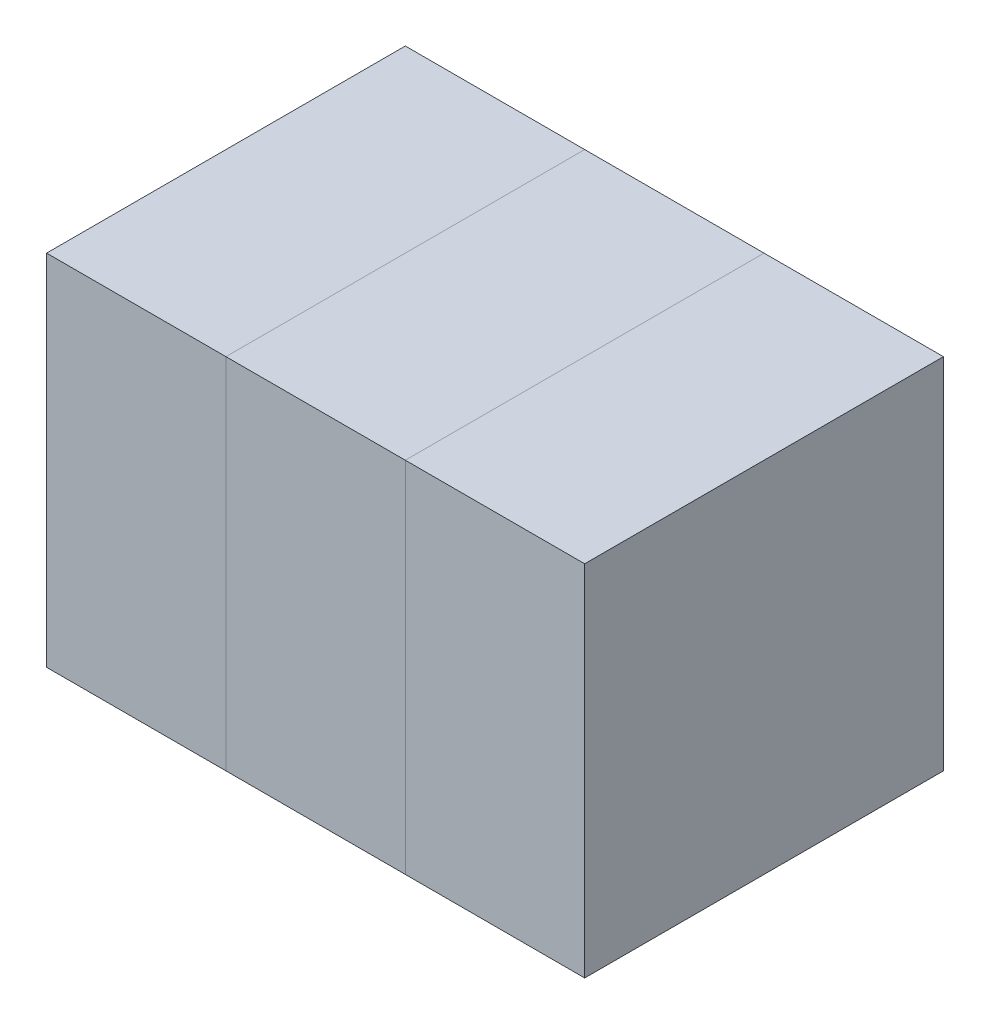
ISO-10303-21;
HEADER;
FILE_DESCRIPTION(('STEP AP214'),'2;1');
FILE_NAME('part.step','',(''),(''),'','','');
FILE_SCHEMA(('AUTOMOTIVE_DESIGN { 1 0 10303 214 1 1 1 1 }'));
ENDSEC;
DATA;
#1=APPLICATION_CONTEXT('core data for automotive mechanical design processes');
#2=APPLICATION_PROTOCOL_DEFINITION('international standard','automotive_design',2000,#1);
#3=PRODUCT_CONTEXT('',#1,'mechanical');
#4=PRODUCT('Part','Part','',(#3));
#5=PRODUCT_RELATED_PRODUCT_CATEGORY('part','',(#4));
#6=PRODUCT_DEFINITION_FORMATION('','',#4);
#7=PRODUCT_DEFINITION_CONTEXT('part definition',#1,'design');
#8=PRODUCT_DEFINITION('design','',#6,#7);
#9=PRODUCT_DEFINITION_SHAPE('','',#8);
#10=(LENGTH_UNIT() NAMED_UNIT(*) SI_UNIT(.MILLI.,.METRE.));
#11=(NAMED_UNIT(*) PLANE_ANGLE_UNIT() SI_UNIT($,.RADIAN.));
#12=(NAMED_UNIT(*) SI_UNIT($,.STERADIAN.) SOLID_ANGLE_UNIT());
#13=UNCERTAINTY_MEASURE_WITH_UNIT(LENGTH_MEASURE(1.E-05),#10,'distance_accuracy_value','');
#14=(GEOMETRIC_REPRESENTATION_CONTEXT(3) GLOBAL_UNCERTAINTY_ASSIGNED_CONTEXT((#13)) GLOBAL_UNIT_ASSIGNED_CONTEXT((#10,
#11,#12)) REPRESENTATION_CONTEXT('',''));
#15=CARTESIAN_POINT('',(0.,0.,0.));
#16=DIRECTION('',(0.,0.,1.));
#17=DIRECTION('',(1.,0.,0.));
#18=AXIS2_PLACEMENT_3D('',#15,#16,#17);
#19=CARTESIAN_POINT('',(0.2,0.8,-0.4));
#20=DIRECTION('',(1.,0.,0.));
#21=DIRECTION('',(0.,0.,-1.));
#22=AXIS2_PLACEMENT_3D('',#19,#20,#21);
#23=PLANE('',#22);
#24=DIRECTION('',(0.,0.,1.));
#25=VECTOR('',#24,1.);
#26=CARTESIAN_POINT('',(0.2,0.,-0.4));
#27=LINE('',#26,#25);
#28=CARTESIAN_POINT('',(0.2,0.,-0.4));
#29=VERTEX_POINT('',#28);
#30=CARTESIAN_POINT('',(0.2,0.,0.4));
#31=VERTEX_POINT('',#30);
#32=EDGE_CURVE('E107',#29,#31,#27,.T.);
#33=ORIENTED_EDGE('',*,*,#32,.T.);
#34=DIRECTION('',(0.,-1.,0.));
#35=VECTOR('',#34,1.);
#36=CARTESIAN_POINT('',(0.2,0.8,0.4));
#37=LINE('',#36,#35);
#38=CARTESIAN_POINT('',(0.2,0.8,0.4));
#39=VERTEX_POINT('',#38);
#40=EDGE_CURVE('E12',#39,#31,#37,.T.);
#41=ORIENTED_EDGE('',*,*,#40,.F.);
#42=DIRECTION('',(0.,0.,1.));
#43=VECTOR('',#42,1.);
#44=CARTESIAN_POINT('',(0.2,0.8,-0.4));
#45=LINE('',#44,#43);
#46=CARTESIAN_POINT('',(0.2,0.8,-0.4));
#47=VERTEX_POINT('',#46);
#48=EDGE_CURVE('E95',#47,#39,#45,.T.);
#49=ORIENTED_EDGE('',*,*,#48,.F.);
#50=DIRECTION('',(0.,-1.,0.));
#51=VECTOR('',#50,1.);
#52=CARTESIAN_POINT('',(0.2,0.8,-0.4));
#53=LINE('',#52,#51);
#54=EDGE_CURVE('E103',#47,#29,#53,.T.);
#55=ORIENTED_EDGE('',*,*,#54,.T.);
#56=EDGE_LOOP('',(#33,#41,#49,#55));
#57=FACE_BOUND('',#56,.T.);
#58=ADVANCED_FACE('F44',(#57),#23,.F.);
#59=CARTESIAN_POINT('',(0.2,0.8,0.4));
#60=DIRECTION('',(0.,0.,-1.));
#61=DIRECTION('',(-1.,0.,0.));
#62=AXIS2_PLACEMENT_3D('',#59,#60,#61);
#63=PLANE('',#62);
#64=DIRECTION('',(1.,0.,0.));
#65=VECTOR('',#64,1.);
#66=CARTESIAN_POINT('',(0.2,0.,0.4));
#67=LINE('',#66,#65);
#68=CARTESIAN_POINT('',(0.6,0.,0.4));
#69=VERTEX_POINT('',#68);
#70=EDGE_CURVE('E99',#31,#69,#67,.T.);
#71=ORIENTED_EDGE('',*,*,#70,.T.);
#72=DIRECTION('',(0.,-1.,0.));
#73=VECTOR('',#72,1.);
#74=CARTESIAN_POINT('',(0.6,0.8,0.4));
#75=LINE('',#74,#73);
#76=CARTESIAN_POINT('',(0.6,0.8,0.4));
#77=VERTEX_POINT('',#76);
#78=EDGE_CURVE('E52',#77,#69,#75,.T.);
#79=ORIENTED_EDGE('',*,*,#78,.F.);
#80=DIRECTION('',(1.,0.,0.));
#81=VECTOR('',#80,1.);
#82=CARTESIAN_POINT('',(0.2,0.8,0.4));
#83=LINE('',#82,#81);
#84=EDGE_CURVE('E90',#39,#77,#83,.T.);
#85=ORIENTED_EDGE('',*,*,#84,.F.);
#86=ORIENTED_EDGE('',*,*,#40,.T.);
#87=EDGE_LOOP('',(#71,#79,#85,#86));
#88=FACE_BOUND('',#87,.T.);
#89=ADVANCED_FACE('F98',(#88),#63,.F.);
#90=CARTESIAN_POINT('',(0.6,0.8,-0.4));
#91=DIRECTION('',(-1.,0.,0.));
#92=DIRECTION('',(0.,0.,1.));
#93=AXIS2_PLACEMENT_3D('',#90,#91,#92);
#94=PLANE('',#93);
#95=DIRECTION('',(0.,0.,-1.));
#96=VECTOR('',#95,1.);
#97=CARTESIAN_POINT('',(0.6,0.,-0.4));
#98=LINE('',#97,#96);
#99=CARTESIAN_POINT('',(0.6,0.,-0.4));
#100=VERTEX_POINT('',#99);
#101=EDGE_CURVE('E77',#69,#100,#98,.T.);
#102=ORIENTED_EDGE('',*,*,#101,.T.);
#103=DIRECTION('',(0.,-1.,0.));
#104=VECTOR('',#103,1.);
#105=CARTESIAN_POINT('',(0.6,0.8,-0.4));
#106=LINE('',#105,#104);
#107=CARTESIAN_POINT('',(0.6,0.8,-0.4));
#108=VERTEX_POINT('',#107);
#109=EDGE_CURVE('E100',#108,#100,#106,.T.);
#110=ORIENTED_EDGE('',*,*,#109,.F.);
#111=DIRECTION('',(0.,0.,-1.));
#112=VECTOR('',#111,1.);
#113=CARTESIAN_POINT('',(0.6,0.8,-0.4));
#114=LINE('',#113,#112);
#115=EDGE_CURVE('E93',#77,#108,#114,.T.);
#116=ORIENTED_EDGE('',*,*,#115,.F.);
#117=ORIENTED_EDGE('',*,*,#78,.T.);
#118=EDGE_LOOP('',(#102,#110,#116,#117));
#119=FACE_BOUND('',#118,.T.);
#120=ADVANCED_FACE('F101',(#119),#94,.F.);
#121=CARTESIAN_POINT('',(0.2,0.8,-0.4));
#122=DIRECTION('',(0.,0.,1.));
#123=DIRECTION('',(1.,0.,0.));
#124=AXIS2_PLACEMENT_3D('',#121,#122,#123);
#125=PLANE('',#124);
#126=DIRECTION('',(-1.,0.,0.));
#127=VECTOR('',#126,1.);
#128=CARTESIAN_POINT('',(0.2,0.,-0.4));
#129=LINE('',#128,#127);
#130=EDGE_CURVE('E83',#100,#29,#129,.T.);
#131=ORIENTED_EDGE('',*,*,#130,.T.);
#132=ORIENTED_EDGE('',*,*,#54,.F.);
#133=DIRECTION('',(-1.,0.,0.));
#134=VECTOR('',#133,1.);
#135=CARTESIAN_POINT('',(0.2,0.8,-0.4));
#136=LINE('',#135,#134);
#137=EDGE_CURVE('E60',#108,#47,#136,.T.);
#138=ORIENTED_EDGE('',*,*,#137,.F.);
#139=ORIENTED_EDGE('',*,*,#109,.T.);
#140=EDGE_LOOP('',(#131,#132,#138,#139));
#141=FACE_BOUND('',#140,.T.);
#142=ADVANCED_FACE('F114',(#141),#125,.F.);
#143=CARTESIAN_POINT('',(0.,0.8,0.));
#144=DIRECTION('',(0.,1.,0.));
#145=DIRECTION('',(0.,0.,1.));
#146=AXIS2_PLACEMENT_3D('',#143,#144,#145);
#147=PLANE('',#146);
#148=ORIENTED_EDGE('',*,*,#48,.T.);
#149=ORIENTED_EDGE('',*,*,#84,.T.);
#150=ORIENTED_EDGE('',*,*,#115,.T.);
#151=ORIENTED_EDGE('',*,*,#137,.T.);
#152=EDGE_LOOP('',(#148,#149,#150,#151));
#153=FACE_BOUND('',#152,.T.);
#154=ADVANCED_FACE('F91',(#153),#147,.T.);
#155=CARTESIAN_POINT('',(0.,0.,0.));
#156=DIRECTION('',(0.,1.,0.));
#157=DIRECTION('',(0.,0.,1.));
#158=AXIS2_PLACEMENT_3D('',#155,#156,#157);
#159=PLANE('',#158);
#160=ORIENTED_EDGE('',*,*,#32,.F.);
#161=ORIENTED_EDGE('',*,*,#130,.F.);
#162=ORIENTED_EDGE('',*,*,#101,.F.);
#163=ORIENTED_EDGE('',*,*,#70,.F.);
#164=EDGE_LOOP('',(#160,#161,#162,#163));
#165=FACE_BOUND('',#164,.T.);
#166=ADVANCED_FACE('F117',(#165),#159,.F.);
#167=CLOSED_SHELL('',(#58,#89,#120,#142,#154,#166));
#168=MANIFOLD_SOLID_BREP('B2',#167);
#169=CARTESIAN_POINT('',(-0.2,0.8,-0.4));
#170=DIRECTION('',(-1.,0.,0.));
#171=DIRECTION('',(0.,0.,1.));
#172=AXIS2_PLACEMENT_3D('',#169,#170,#171);
#173=PLANE('',#172);
#174=DIRECTION('',(0.,0.,-1.));
#175=VECTOR('',#174,1.);
#176=CARTESIAN_POINT('',(-0.2,0.,-0.4));
#177=LINE('',#176,#175);
#178=CARTESIAN_POINT('',(-0.2,0.,0.4));
#179=VERTEX_POINT('',#178);
#180=CARTESIAN_POINT('',(-0.2,0.,-0.4));
#181=VERTEX_POINT('',#180);
#182=EDGE_CURVE('E240',#179,#181,#177,.T.);
#183=ORIENTED_EDGE('',*,*,#182,.T.);
#184=DIRECTION('',(0.,-1.,0.));
#185=VECTOR('',#184,1.);
#186=CARTESIAN_POINT('',(-0.2,0.8,-0.4));
#187=LINE('',#186,#185);
#188=CARTESIAN_POINT('',(-0.2,0.8,-0.4));
#189=VERTEX_POINT('',#188);
#190=EDGE_CURVE('E42',#189,#181,#187,.T.);
#191=ORIENTED_EDGE('',*,*,#190,.F.);
#192=DIRECTION('',(0.,0.,-1.));
#193=VECTOR('',#192,1.);
#194=CARTESIAN_POINT('',(-0.2,0.8,-0.4));
#195=LINE('',#194,#193);
#196=CARTESIAN_POINT('',(-0.2,0.8,0.4));
#197=VERTEX_POINT('',#196);
#198=EDGE_CURVE('E228',#197,#189,#195,.T.);
#199=ORIENTED_EDGE('',*,*,#198,.F.);
#200=DIRECTION('',(0.,-1.,0.));
#201=VECTOR('',#200,1.);
#202=CARTESIAN_POINT('',(-0.2,0.8,0.4));
#203=LINE('',#202,#201);
#204=EDGE_CURVE('E236',#197,#179,#203,.T.);
#205=ORIENTED_EDGE('',*,*,#204,.T.);
#206=EDGE_LOOP('',(#183,#191,#199,#205));
#207=FACE_BOUND('',#206,.T.);
#208=ADVANCED_FACE('F177',(#207),#173,.F.);
#209=CARTESIAN_POINT('',(-0.2,0.8,-0.4));
#210=DIRECTION('',(0.,0.,1.));
#211=DIRECTION('',(1.,0.,0.));
#212=AXIS2_PLACEMENT_3D('',#209,#210,#211);
#213=PLANE('',#212);
#214=DIRECTION('',(-1.,0.,0.));
#215=VECTOR('',#214,1.);
#216=CARTESIAN_POINT('',(-0.2,0.,-0.4));
#217=LINE('',#216,#215);
#218=CARTESIAN_POINT('',(-0.6,0.,-0.4));
#219=VERTEX_POINT('',#218);
#220=EDGE_CURVE('E232',#181,#219,#217,.T.);
#221=ORIENTED_EDGE('',*,*,#220,.T.);
#222=DIRECTION('',(0.,-1.,0.));
#223=VECTOR('',#222,1.);
#224=CARTESIAN_POINT('',(-0.6,0.8,-0.4));
#225=LINE('',#224,#223);
#226=CARTESIAN_POINT('',(-0.6,0.8,-0.4));
#227=VERTEX_POINT('',#226);
#228=EDGE_CURVE('E185',#227,#219,#225,.T.);
#229=ORIENTED_EDGE('',*,*,#228,.F.);
#230=DIRECTION('',(-1.,0.,0.));
#231=VECTOR('',#230,1.);
#232=CARTESIAN_POINT('',(-0.2,0.8,-0.4));
#233=LINE('',#232,#231);
#234=EDGE_CURVE('E223',#189,#227,#233,.T.);
#235=ORIENTED_EDGE('',*,*,#234,.F.);
#236=ORIENTED_EDGE('',*,*,#190,.T.);
#237=EDGE_LOOP('',(#221,#229,#235,#236));
#238=FACE_BOUND('',#237,.T.);
#239=ADVANCED_FACE('F231',(#238),#213,.F.);
#240=CARTESIAN_POINT('',(-0.6,0.8,-0.4));
#241=DIRECTION('',(1.,0.,0.));
#242=DIRECTION('',(0.,0.,-1.));
#243=AXIS2_PLACEMENT_3D('',#240,#241,#242);
#244=PLANE('',#243);
#245=DIRECTION('',(0.,0.,1.));
#246=VECTOR('',#245,1.);
#247=CARTESIAN_POINT('',(-0.6,0.,-0.4));
#248=LINE('',#247,#246);
#249=CARTESIAN_POINT('',(-0.6,0.,0.4));
#250=VERTEX_POINT('',#249);
#251=EDGE_CURVE('E210',#219,#250,#248,.T.);
#252=ORIENTED_EDGE('',*,*,#251,.T.);
#253=DIRECTION('',(0.,-1.,0.));
#254=VECTOR('',#253,1.);
#255=CARTESIAN_POINT('',(-0.6,0.8,0.4));
#256=LINE('',#255,#254);
#257=CARTESIAN_POINT('',(-0.6,0.8,0.4));
#258=VERTEX_POINT('',#257);
#259=EDGE_CURVE('E233',#258,#250,#256,.T.);
#260=ORIENTED_EDGE('',*,*,#259,.F.);
#261=DIRECTION('',(0.,0.,1.));
#262=VECTOR('',#261,1.);
#263=CARTESIAN_POINT('',(-0.6,0.8,-0.4));
#264=LINE('',#263,#262);
#265=EDGE_CURVE('E226',#227,#258,#264,.T.);
#266=ORIENTED_EDGE('',*,*,#265,.F.);
#267=ORIENTED_EDGE('',*,*,#228,.T.);
#268=EDGE_LOOP('',(#252,#260,#266,#267));
#269=FACE_BOUND('',#268,.T.);
#270=ADVANCED_FACE('F234',(#269),#244,.F.);
#271=CARTESIAN_POINT('',(-0.2,0.8,0.4));
#272=DIRECTION('',(0.,0.,-1.));
#273=DIRECTION('',(-1.,0.,0.));
#274=AXIS2_PLACEMENT_3D('',#271,#272,#273);
#275=PLANE('',#274);
#276=DIRECTION('',(1.,0.,0.));
#277=VECTOR('',#276,1.);
#278=CARTESIAN_POINT('',(-0.2,0.,0.4));
#279=LINE('',#278,#277);
#280=EDGE_CURVE('E216',#250,#179,#279,.T.);
#281=ORIENTED_EDGE('',*,*,#280,.T.);
#282=ORIENTED_EDGE('',*,*,#204,.F.);
#283=DIRECTION('',(1.,0.,0.));
#284=VECTOR('',#283,1.);
#285=CARTESIAN_POINT('',(-0.2,0.8,0.4));
#286=LINE('',#285,#284);
#287=EDGE_CURVE('E193',#258,#197,#286,.T.);
#288=ORIENTED_EDGE('',*,*,#287,.F.);
#289=ORIENTED_EDGE('',*,*,#259,.T.);
#290=EDGE_LOOP('',(#281,#282,#288,#289));
#291=FACE_BOUND('',#290,.T.);
#292=ADVANCED_FACE('F247',(#291),#275,.F.);
#293=CARTESIAN_POINT('',(0.,0.8,0.));
#294=DIRECTION('',(0.,-1.,0.));
#295=DIRECTION('',(0.,0.,-1.));
#296=AXIS2_PLACEMENT_3D('',#293,#294,#295);
#297=PLANE('',#296);
#298=ORIENTED_EDGE('',*,*,#198,.T.);
#299=ORIENTED_EDGE('',*,*,#234,.T.);
#300=ORIENTED_EDGE('',*,*,#265,.T.);
#301=ORIENTED_EDGE('',*,*,#287,.T.);
#302=EDGE_LOOP('',(#298,#299,#300,#301));
#303=FACE_BOUND('',#302,.T.);
#304=ADVANCED_FACE('F224',(#303),#297,.F.);
#305=CARTESIAN_POINT('',(0.,0.,0.));
#306=DIRECTION('',(0.,-1.,0.));
#307=DIRECTION('',(0.,0.,-1.));
#308=AXIS2_PLACEMENT_3D('',#305,#306,#307);
#309=PLANE('',#308);
#310=ORIENTED_EDGE('',*,*,#182,.F.);
#311=ORIENTED_EDGE('',*,*,#280,.F.);
#312=ORIENTED_EDGE('',*,*,#251,.F.);
#313=ORIENTED_EDGE('',*,*,#220,.F.);
#314=EDGE_LOOP('',(#310,#311,#312,#313));
#315=FACE_BOUND('',#314,.T.);
#316=ADVANCED_FACE('F250',(#315),#309,.T.);
#317=CLOSED_SHELL('',(#208,#239,#270,#292,#304,#316));
#318=MANIFOLD_SOLID_BREP('B6',#317);
#319=CARTESIAN_POINT('',(0.2,0.8,0.4));
#320=DIRECTION('',(-1.,0.,0.));
#321=DIRECTION('',(0.,0.,1.));
#322=AXIS2_PLACEMENT_3D('',#319,#320,#321);
#323=PLANE('',#322);
#324=DIRECTION('',(0.,0.,-1.));
#325=VECTOR('',#324,1.);
#326=CARTESIAN_POINT('',(0.2,0.,0.4));
#327=LINE('',#326,#325);
#328=CARTESIAN_POINT('',(0.2,0.,0.4));
#329=VERTEX_POINT('',#328);
#330=CARTESIAN_POINT('',(0.2,0.,-0.4));
#331=VERTEX_POINT('',#330);
#332=EDGE_CURVE('E364',#329,#331,#327,.T.);
#333=ORIENTED_EDGE('',*,*,#332,.T.);
#334=DIRECTION('',(0.,-1.,0.));
#335=VECTOR('',#334,1.);
#336=CARTESIAN_POINT('',(0.2,0.8,-0.4));
#337=LINE('',#336,#335);
#338=CARTESIAN_POINT('',(0.2,0.8,-0.4));
#339=VERTEX_POINT('',#338);
#340=EDGE_CURVE('E175',#339,#331,#337,.T.);
#341=ORIENTED_EDGE('',*,*,#340,.F.);
#342=DIRECTION('',(0.,0.,-1.));
#343=VECTOR('',#342,1.);
#344=CARTESIAN_POINT('',(0.2,0.8,0.4));
#345=LINE('',#344,#343);
#346=CARTESIAN_POINT('',(0.2,0.8,0.4));
#347=VERTEX_POINT('',#346);
#348=EDGE_CURVE('E352',#347,#339,#345,.T.);
#349=ORIENTED_EDGE('',*,*,#348,.F.);
#350=DIRECTION('',(0.,-1.,0.));
#351=VECTOR('',#350,1.);
#352=CARTESIAN_POINT('',(0.2,0.8,0.4));
#353=LINE('',#352,#351);
#354=EDGE_CURVE('E360',#347,#329,#353,.T.);
#355=ORIENTED_EDGE('',*,*,#354,.T.);
#356=EDGE_LOOP('',(#333,#341,#349,#355));
#357=FACE_BOUND('',#356,.T.);
#358=ADVANCED_FACE('F301',(#357),#323,.F.);
#359=CARTESIAN_POINT('',(-0.2,0.8,-0.4));
#360=DIRECTION('',(0.,0.,1.));
#361=DIRECTION('',(1.,0.,0.));
#362=AXIS2_PLACEMENT_3D('',#359,#360,#361);
#363=PLANE('',#362);
#364=DIRECTION('',(-1.,0.,0.));
#365=VECTOR('',#364,1.);
#366=CARTESIAN_POINT('',(-0.2,0.,-0.4));
#367=LINE('',#366,#365);
#368=CARTESIAN_POINT('',(-0.2,0.,-0.4));
#369=VERTEX_POINT('',#368);
#370=EDGE_CURVE('E356',#331,#369,#367,.T.);
#371=ORIENTED_EDGE('',*,*,#370,.T.);
#372=DIRECTION('',(0.,-1.,0.));
#373=VECTOR('',#372,1.);
#374=CARTESIAN_POINT('',(-0.2,0.8,-0.4));
#375=LINE('',#374,#373);
#376=CARTESIAN_POINT('',(-0.2,0.8,-0.4));
#377=VERTEX_POINT('',#376);
#378=EDGE_CURVE('E309',#377,#369,#375,.T.);
#379=ORIENTED_EDGE('',*,*,#378,.F.);
#380=DIRECTION('',(-1.,0.,0.));
#381=VECTOR('',#380,1.);
#382=CARTESIAN_POINT('',(-0.2,0.8,-0.4));
#383=LINE('',#382,#381);
#384=EDGE_CURVE('E347',#339,#377,#383,.T.);
#385=ORIENTED_EDGE('',*,*,#384,.F.);
#386=ORIENTED_EDGE('',*,*,#340,.T.);
#387=EDGE_LOOP('',(#371,#379,#385,#386));
#388=FACE_BOUND('',#387,.T.);
#389=ADVANCED_FACE('F355',(#388),#363,.F.);
#390=CARTESIAN_POINT('',(-0.2,0.8,0.4));
#391=DIRECTION('',(1.,0.,0.));
#392=DIRECTION('',(0.,0.,-1.));
#393=AXIS2_PLACEMENT_3D('',#390,#391,#392);
#394=PLANE('',#393);
#395=DIRECTION('',(0.,0.,1.));
#396=VECTOR('',#395,1.);
#397=CARTESIAN_POINT('',(-0.2,0.,0.4));
#398=LINE('',#397,#396);
#399=CARTESIAN_POINT('',(-0.2,0.,0.4));
#400=VERTEX_POINT('',#399);
#401=EDGE_CURVE('E334',#369,#400,#398,.T.);
#402=ORIENTED_EDGE('',*,*,#401,.T.);
#403=DIRECTION('',(0.,-1.,0.));
#404=VECTOR('',#403,1.);
#405=CARTESIAN_POINT('',(-0.2,0.8,0.4));
#406=LINE('',#405,#404);
#407=CARTESIAN_POINT('',(-0.2,0.8,0.4));
#408=VERTEX_POINT('',#407);
#409=EDGE_CURVE('E357',#408,#400,#406,.T.);
#410=ORIENTED_EDGE('',*,*,#409,.F.);
#411=DIRECTION('',(0.,0.,1.));
#412=VECTOR('',#411,1.);
#413=CARTESIAN_POINT('',(-0.2,0.8,0.4));
#414=LINE('',#413,#412);
#415=EDGE_CURVE('E350',#377,#408,#414,.T.);
#416=ORIENTED_EDGE('',*,*,#415,.F.);
#417=ORIENTED_EDGE('',*,*,#378,.T.);
#418=EDGE_LOOP('',(#402,#410,#416,#417));
#419=FACE_BOUND('',#418,.T.);
#420=ADVANCED_FACE('F358',(#419),#394,.F.);
#421=CARTESIAN_POINT('',(-0.2,0.8,0.4));
#422=DIRECTION('',(0.,0.,-1.));
#423=DIRECTION('',(-1.,0.,0.));
#424=AXIS2_PLACEMENT_3D('',#421,#422,#423);
#425=PLANE('',#424);
#426=DIRECTION('',(1.,0.,0.));
#427=VECTOR('',#426,1.);
#428=CARTESIAN_POINT('',(-0.2,0.,0.4));
#429=LINE('',#428,#427);
#430=EDGE_CURVE('E340',#400,#329,#429,.T.);
#431=ORIENTED_EDGE('',*,*,#430,.T.);
#432=ORIENTED_EDGE('',*,*,#354,.F.);
#433=DIRECTION('',(1.,0.,0.));
#434=VECTOR('',#433,1.);
#435=CARTESIAN_POINT('',(-0.2,0.8,0.4));
#436=LINE('',#435,#434);
#437=EDGE_CURVE('E317',#408,#347,#436,.T.);
#438=ORIENTED_EDGE('',*,*,#437,.F.);
#439=ORIENTED_EDGE('',*,*,#409,.T.);
#440=EDGE_LOOP('',(#431,#432,#438,#439));
#441=FACE_BOUND('',#440,.T.);
#442=ADVANCED_FACE('F371',(#441),#425,.F.);
#443=CARTESIAN_POINT('',(0.,0.8,0.));
#444=DIRECTION('',(0.,-1.,0.));
#445=DIRECTION('',(0.,0.,-1.));
#446=AXIS2_PLACEMENT_3D('',#443,#444,#445);
#447=PLANE('',#446);
#448=ORIENTED_EDGE('',*,*,#348,.T.);
#449=ORIENTED_EDGE('',*,*,#384,.T.);
#450=ORIENTED_EDGE('',*,*,#415,.T.);
#451=ORIENTED_EDGE('',*,*,#437,.T.);
#452=EDGE_LOOP('',(#448,#449,#450,#451));
#453=FACE_BOUND('',#452,.T.);
#454=ADVANCED_FACE('F348',(#453),#447,.F.);
#455=CARTESIAN_POINT('',(0.,0.,0.));
#456=DIRECTION('',(0.,-1.,0.));
#457=DIRECTION('',(0.,0.,-1.));
#458=AXIS2_PLACEMENT_3D('',#455,#456,#457);
#459=PLANE('',#458);
#460=ORIENTED_EDGE('',*,*,#332,.F.);
#461=ORIENTED_EDGE('',*,*,#430,.F.);
#462=ORIENTED_EDGE('',*,*,#401,.F.);
#463=ORIENTED_EDGE('',*,*,#370,.F.);
#464=EDGE_LOOP('',(#460,#461,#462,#463));
#465=FACE_BOUND('',#464,.T.);
#466=ADVANCED_FACE('F374',(#465),#459,.T.);
#467=CLOSED_SHELL('',(#358,#389,#420,#442,#454,#466));
#468=MANIFOLD_SOLID_BREP('B36',#467);
#469=ADVANCED_BREP_SHAPE_REPRESENTATION('',(#18,#168,#318,#468),#14);
#470=SHAPE_DEFINITION_REPRESENTATION(#9,#469);
ENDSEC;
END-ISO-10303-21;
